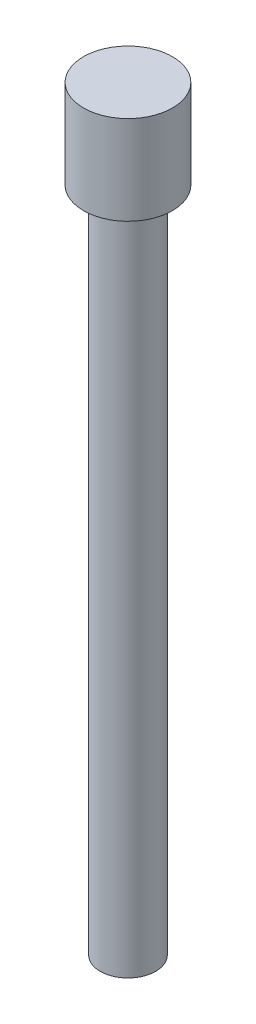
ISO-10303-21;
HEADER;
FILE_DESCRIPTION(('STEP AP214'),'2;1');
FILE_NAME('part.step','',(''),(''),'','','');
FILE_SCHEMA(('AUTOMOTIVE_DESIGN { 1 0 10303 214 1 1 1 1 }'));
ENDSEC;
DATA;
#1=APPLICATION_CONTEXT('core data for automotive mechanical design processes');
#2=APPLICATION_PROTOCOL_DEFINITION('international standard','automotive_design',2000,#1);
#3=PRODUCT_CONTEXT('',#1,'mechanical');
#4=PRODUCT('Part','Part','',(#3));
#5=PRODUCT_RELATED_PRODUCT_CATEGORY('part','',(#4));
#6=PRODUCT_DEFINITION_FORMATION('','',#4);
#7=PRODUCT_DEFINITION_CONTEXT('part definition',#1,'design');
#8=PRODUCT_DEFINITION('design','',#6,#7);
#9=PRODUCT_DEFINITION_SHAPE('','',#8);
#10=(LENGTH_UNIT() NAMED_UNIT(*) SI_UNIT(.MILLI.,.METRE.));
#11=(NAMED_UNIT(*) PLANE_ANGLE_UNIT() SI_UNIT($,.RADIAN.));
#12=(NAMED_UNIT(*) SI_UNIT($,.STERADIAN.) SOLID_ANGLE_UNIT());
#13=UNCERTAINTY_MEASURE_WITH_UNIT(LENGTH_MEASURE(1.E-05),#10,'distance_accuracy_value','');
#14=(GEOMETRIC_REPRESENTATION_CONTEXT(3) GLOBAL_UNCERTAINTY_ASSIGNED_CONTEXT((#13)) GLOBAL_UNIT_ASSIGNED_CONTEXT((#10,
#11,#12)) REPRESENTATION_CONTEXT('',''));
#15=CARTESIAN_POINT('',(0.,0.,0.));
#16=DIRECTION('',(0.,0.,1.));
#17=DIRECTION('',(1.,0.,0.));
#18=AXIS2_PLACEMENT_3D('',#15,#16,#17);
#19=CARTESIAN_POINT('',(0.,30.,0.));
#20=DIRECTION('',(0.,-1.,0.));
#21=DIRECTION('',(0.,0.,-1.));
#22=AXIS2_PLACEMENT_3D('',#19,#20,#21);
#23=CYLINDRICAL_SURFACE('',#22,1.25);
#24=CARTESIAN_POINT('',(0.,30.,0.));
#25=DIRECTION('',(0.,1.,0.));
#26=DIRECTION('',(0.,0.,1.));
#27=AXIS2_PLACEMENT_3D('',#24,#25,#26);
#28=CIRCLE('',#27,1.25);
#29=CARTESIAN_POINT('',(0.,30.,1.25));
#30=VERTEX_POINT('',#29);
#31=EDGE_CURVE('E10',#30,#30,#28,.T.);
#32=ORIENTED_EDGE('',*,*,#31,.F.);
#33=EDGE_LOOP('',(#32));
#34=FACE_BOUND('',#33,.T.);
#35=CARTESIAN_POINT('',(0.,0.,0.));
#36=DIRECTION('',(0.,1.,0.));
#37=DIRECTION('',(0.,0.,1.));
#38=AXIS2_PLACEMENT_3D('',#35,#36,#37);
#39=CIRCLE('',#38,1.25);
#40=CARTESIAN_POINT('',(0.,0.,1.25));
#41=VERTEX_POINT('',#40);
#42=EDGE_CURVE('E40',#41,#41,#39,.T.);
#43=ORIENTED_EDGE('',*,*,#42,.T.);
#44=EDGE_LOOP('',(#43));
#45=FACE_BOUND('',#44,.T.);
#46=ADVANCED_FACE('F37',(#34,#45),#23,.T.);
#47=CARTESIAN_POINT('',(0.,0.,0.));
#48=DIRECTION('',(0.,1.,0.));
#49=DIRECTION('',(0.,0.,1.));
#50=AXIS2_PLACEMENT_3D('',#47,#48,#49);
#51=PLANE('',#50);
#52=ORIENTED_EDGE('',*,*,#42,.F.);
#53=EDGE_LOOP('',(#52));
#54=FACE_BOUND('',#53,.T.);
#55=ADVANCED_FACE('F64',(#54),#51,.F.);
#56=CARTESIAN_POINT('',(0.,34.,0.));
#57=DIRECTION('',(0.,-1.,0.));
#58=DIRECTION('',(0.,0.,-1.));
#59=AXIS2_PLACEMENT_3D('',#56,#57,#58);
#60=CYLINDRICAL_SURFACE('',#59,2.);
#61=CARTESIAN_POINT('',(0.,34.,0.));
#62=DIRECTION('',(0.,1.,0.));
#63=DIRECTION('',(0.,0.,1.));
#64=AXIS2_PLACEMENT_3D('',#61,#62,#63);
#65=CIRCLE('',#64,2.);
#66=CARTESIAN_POINT('',(0.,34.,2.));
#67=VERTEX_POINT('',#66);
#68=EDGE_CURVE('E49',#67,#67,#65,.T.);
#69=ORIENTED_EDGE('',*,*,#68,.F.);
#70=EDGE_LOOP('',(#69));
#71=FACE_BOUND('',#70,.T.);
#72=CARTESIAN_POINT('',(0.,30.,0.));
#73=DIRECTION('',(0.,1.,0.));
#74=DIRECTION('',(0.,0.,1.));
#75=AXIS2_PLACEMENT_3D('',#72,#73,#74);
#76=CIRCLE('',#75,2.);
#77=CARTESIAN_POINT('',(0.,30.,2.));
#78=VERTEX_POINT('',#77);
#79=EDGE_CURVE('E51',#78,#78,#76,.T.);
#80=ORIENTED_EDGE('',*,*,#79,.T.);
#81=EDGE_LOOP('',(#80));
#82=FACE_BOUND('',#81,.T.);
#83=ADVANCED_FACE('F61',(#71,#82),#60,.T.);
#84=CARTESIAN_POINT('',(0.,34.,0.));
#85=DIRECTION('',(0.,1.,0.));
#86=DIRECTION('',(0.,0.,1.));
#87=AXIS2_PLACEMENT_3D('',#84,#85,#86);
#88=PLANE('',#87);
#89=ORIENTED_EDGE('',*,*,#68,.T.);
#90=EDGE_LOOP('',(#89));
#91=FACE_BOUND('',#90,.T.);
#92=ADVANCED_FACE('F59',(#91),#88,.T.);
#93=CARTESIAN_POINT('',(0.,30.,0.));
#94=DIRECTION('',(0.,1.,0.));
#95=DIRECTION('',(0.,0.,1.));
#96=AXIS2_PLACEMENT_3D('',#93,#94,#95);
#97=PLANE('',#96);
#98=ORIENTED_EDGE('',*,*,#31,.T.);
#99=EDGE_LOOP('',(#98));
#100=FACE_BOUND('',#99,.T.);
#101=ORIENTED_EDGE('',*,*,#79,.F.);
#102=EDGE_LOOP('',(#101));
#103=FACE_BOUND('',#102,.T.);
#104=ADVANCED_FACE('F68',(#100,#103),#97,.F.);
#105=CLOSED_SHELL('',(#46,#55,#83,#92,#104));
#106=MANIFOLD_SOLID_BREP('B2',#105);
#107=ADVANCED_BREP_SHAPE_REPRESENTATION('',(#18,#106),#14);
#108=SHAPE_DEFINITION_REPRESENTATION(#9,#107);
ENDSEC;
END-ISO-10303-21;
